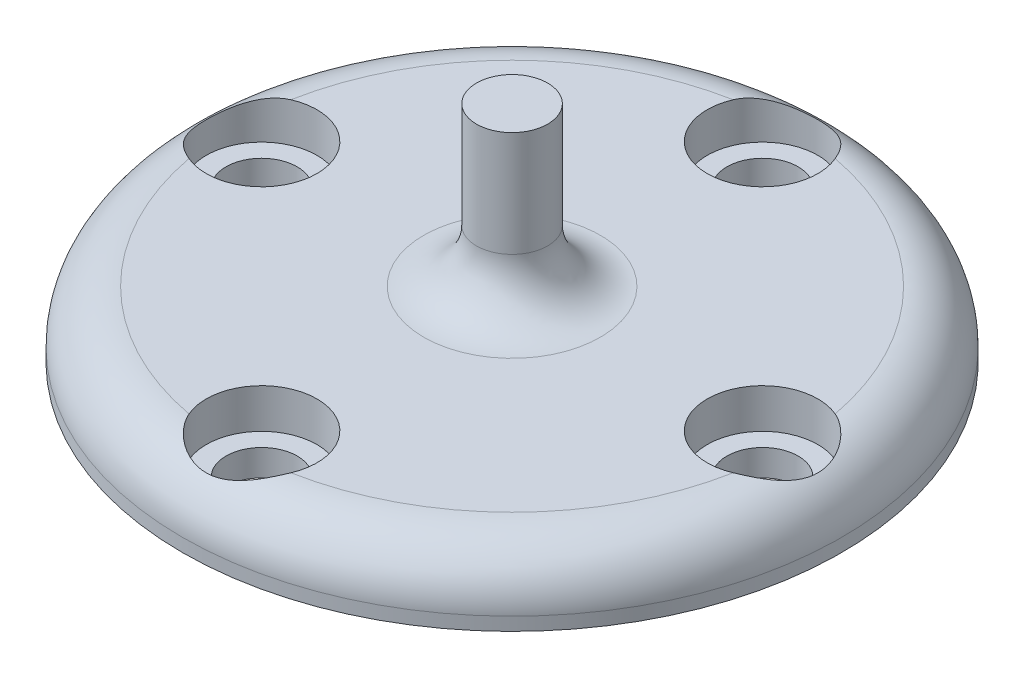
ISO-10303-21;
HEADER;
FILE_DESCRIPTION(('STEP AP214'),'2;1');
FILE_NAME('part.step','',(''),(''),'','','');
FILE_SCHEMA(('AUTOMOTIVE_DESIGN { 1 0 10303 214 1 1 1 1 }'));
ENDSEC;
DATA;
#1=APPLICATION_CONTEXT('core data for automotive mechanical design processes');
#2=APPLICATION_PROTOCOL_DEFINITION('international standard','automotive_design',2000,#1);
#3=PRODUCT_CONTEXT('',#1,'mechanical');
#4=PRODUCT('Part','Part','',(#3));
#5=PRODUCT_RELATED_PRODUCT_CATEGORY('part','',(#4));
#6=PRODUCT_DEFINITION_FORMATION('','',#4);
#7=PRODUCT_DEFINITION_CONTEXT('part definition',#1,'design');
#8=PRODUCT_DEFINITION('design','',#6,#7);
#9=PRODUCT_DEFINITION_SHAPE('','',#8);
#10=(LENGTH_UNIT() NAMED_UNIT(*) SI_UNIT(.MILLI.,.METRE.));
#11=(NAMED_UNIT(*) PLANE_ANGLE_UNIT() SI_UNIT($,.RADIAN.));
#12=(NAMED_UNIT(*) SI_UNIT($,.STERADIAN.) SOLID_ANGLE_UNIT());
#13=UNCERTAINTY_MEASURE_WITH_UNIT(LENGTH_MEASURE(1.E-05),#10,'distance_accuracy_value','');
#14=(GEOMETRIC_REPRESENTATION_CONTEXT(3) GLOBAL_UNCERTAINTY_ASSIGNED_CONTEXT((#13)) GLOBAL_UNIT_ASSIGNED_CONTEXT((#10,
#11,#12)) REPRESENTATION_CONTEXT('',''));
#15=CARTESIAN_POINT('',(0.,0.,0.));
#16=DIRECTION('',(0.,0.,1.));
#17=DIRECTION('',(1.,0.,0.));
#18=AXIS2_PLACEMENT_3D('',#15,#16,#17);
#19=CARTESIAN_POINT('',(0.,0.,-9.5));
#20=DIRECTION('',(0.,1.,0.));
#21=DIRECTION('',(0.,0.,1.));
#22=AXIS2_PLACEMENT_3D('',#19,#20,#21);
#23=CYLINDRICAL_SURFACE('',#22,1.35);
#24=CARTESIAN_POINT('',(0.,0.,-9.5));
#25=DIRECTION('',(0.,1.,0.));
#26=DIRECTION('',(0.,0.,1.));
#27=AXIS2_PLACEMENT_3D('',#24,#25,#26);
#28=CIRCLE('',#27,1.35);
#29=CARTESIAN_POINT('',(0.,0.,-8.15));
#30=VERTEX_POINT('',#29);
#31=EDGE_CURVE('E208',#30,#30,#28,.T.);
#32=ORIENTED_EDGE('',*,*,#31,.F.);
#33=EDGE_LOOP('',(#32));
#34=FACE_BOUND('',#33,.T.);
#35=CARTESIAN_POINT('',(0.,1.,-9.5));
#36=DIRECTION('',(0.,1.,0.));
#37=DIRECTION('',(0.,0.,1.));
#38=AXIS2_PLACEMENT_3D('',#35,#36,#37);
#39=CIRCLE('',#38,1.35);
#40=CARTESIAN_POINT('',(0.,1.,-8.15));
#41=VERTEX_POINT('',#40);
#42=EDGE_CURVE('E211',#41,#41,#39,.F.);
#43=ORIENTED_EDGE('',*,*,#42,.F.);
#44=EDGE_LOOP('',(#43));
#45=FACE_BOUND('',#44,.T.);
#46=ADVANCED_FACE('F42',(#34,#45),#23,.F.);
#47=CARTESIAN_POINT('',(0.,2.5,0.));
#48=DIRECTION('',(0.,-1.,0.));
#49=DIRECTION('',(0.,0.,-1.));
#50=AXIS2_PLACEMENT_3D('',#47,#48,#49);
#51=CYLINDRICAL_SURFACE('',#50,12.5);
#52=CARTESIAN_POINT('',(0.,0.5,0.));
#53=DIRECTION('',(0.,1.,0.));
#54=DIRECTION('',(0.,0.,1.));
#55=AXIS2_PLACEMENT_3D('',#52,#53,#54);
#56=CIRCLE('',#55,12.5);
#57=CARTESIAN_POINT('',(0.,0.5,12.5));
#58=VERTEX_POINT('',#57);
#59=EDGE_CURVE('E11',#58,#58,#56,.F.);
#60=ORIENTED_EDGE('',*,*,#59,.T.);
#61=EDGE_LOOP('',(#60));
#62=FACE_BOUND('',#61,.T.);
#63=CARTESIAN_POINT('',(0.,0.,0.));
#64=DIRECTION('',(0.,1.,0.));
#65=DIRECTION('',(0.,0.,1.));
#66=AXIS2_PLACEMENT_3D('',#63,#64,#65);
#67=CIRCLE('',#66,12.5);
#68=CARTESIAN_POINT('',(0.,0.,12.5));
#69=VERTEX_POINT('',#68);
#70=EDGE_CURVE('E202',#69,#69,#67,.T.);
#71=ORIENTED_EDGE('',*,*,#70,.T.);
#72=EDGE_LOOP('',(#71));
#73=FACE_BOUND('',#72,.T.);
#74=ADVANCED_FACE('F173',(#62,#73),#51,.T.);
#75=CARTESIAN_POINT('',(0.,2.5,0.));
#76=DIRECTION('',(0.,1.,0.));
#77=DIRECTION('',(0.,0.,1.));
#78=AXIS2_PLACEMENT_3D('',#75,#76,#77);
#79=PLANE('',#78);
#80=CARTESIAN_POINT('',(0.,2.5,0.));
#81=DIRECTION('',(0.,1.,0.));
#82=DIRECTION('',(0.,0.,1.));
#83=AXIS2_PLACEMENT_3D('',#80,#81,#82);
#84=CIRCLE('',#83,3.35);
#85=CARTESIAN_POINT('',(0.,2.5,3.35));
#86=VERTEX_POINT('',#85);
#87=EDGE_CURVE('E96',#86,#86,#84,.F.);
#88=ORIENTED_EDGE('',*,*,#87,.T.);
#89=EDGE_LOOP('',(#88));
#90=FACE_BOUND('',#89,.T.);
#91=CARTESIAN_POINT('',(9.5,2.5,0.));
#92=DIRECTION('',(0.,1.,0.));
#93=DIRECTION('',(-1.,0.,0.));
#94=AXIS2_PLACEMENT_3D('',#91,#92,#93);
#95=CIRCLE('',#94,2.1);
#96=CARTESIAN_POINT('',(10.3205263157895,2.5,-1.93306403543618));
#97=VERTEX_POINT('',#96);
#98=CARTESIAN_POINT('',(10.3205263157895,2.5,1.93306403543625));
#99=VERTEX_POINT('',#98);
#100=EDGE_CURVE('E89',#97,#99,#95,.T.);
#101=ORIENTED_EDGE('',*,*,#100,.F.);
#102=CARTESIAN_POINT('',(0.,2.5,0.));
#103=DIRECTION('',(0.,1.,0.));
#104=DIRECTION('',(0.,0.,1.));
#105=AXIS2_PLACEMENT_3D('',#102,#103,#104);
#106=CIRCLE('',#105,10.5);
#107=CARTESIAN_POINT('',(1.93306403543622,2.5,-10.3205263157895));
#108=VERTEX_POINT('',#107);
#109=EDGE_CURVE('E104',#97,#108,#106,.T.);
#110=ORIENTED_EDGE('',*,*,#109,.T.);
#111=CARTESIAN_POINT('',(0.,2.5,-9.5));
#112=DIRECTION('',(0.,1.,0.));
#113=DIRECTION('',(0.,0.,1.));
#114=AXIS2_PLACEMENT_3D('',#111,#112,#113);
#115=CIRCLE('',#114,2.1);
#116=CARTESIAN_POINT('',(-1.93306403543622,2.5,-10.3205263157895));
#117=VERTEX_POINT('',#116);
#118=EDGE_CURVE('E219',#117,#108,#115,.T.);
#119=ORIENTED_EDGE('',*,*,#118,.F.);
#120=CARTESIAN_POINT('',(0.,2.5,0.));
#121=DIRECTION('',(0.,1.,0.));
#122=DIRECTION('',(0.,0.,1.));
#123=AXIS2_PLACEMENT_3D('',#120,#121,#122);
#124=CIRCLE('',#123,10.5);
#125=CARTESIAN_POINT('',(-10.3205263157895,2.5,-1.93306403543633));
#126=VERTEX_POINT('',#125);
#127=EDGE_CURVE('E214',#117,#126,#124,.T.);
#128=ORIENTED_EDGE('',*,*,#127,.T.);
#129=CARTESIAN_POINT('',(-9.5,2.5,0.));
#130=DIRECTION('',(0.,1.,0.));
#131=DIRECTION('',(1.,0.,0.));
#132=AXIS2_PLACEMENT_3D('',#129,#130,#131);
#133=CIRCLE('',#132,2.1);
#134=CARTESIAN_POINT('',(-10.3205263157895,2.5,1.93306403543611));
#135=VERTEX_POINT('',#134);
#136=EDGE_CURVE('E411',#135,#126,#133,.T.);
#137=ORIENTED_EDGE('',*,*,#136,.F.);
#138=CARTESIAN_POINT('',(0.,2.5,0.));
#139=DIRECTION('',(0.,1.,0.));
#140=DIRECTION('',(0.,0.,1.));
#141=AXIS2_PLACEMENT_3D('',#138,#139,#140);
#142=CIRCLE('',#141,10.5);
#143=CARTESIAN_POINT('',(-1.93306403543622,2.5,10.3205263157895));
#144=VERTEX_POINT('',#143);
#145=EDGE_CURVE('E95',#135,#144,#142,.T.);
#146=ORIENTED_EDGE('',*,*,#145,.T.);
#147=CARTESIAN_POINT('',(0.,2.5,9.5));
#148=DIRECTION('',(0.,1.,0.));
#149=DIRECTION('',(0.,0.,-1.));
#150=AXIS2_PLACEMENT_3D('',#147,#148,#149);
#151=CIRCLE('',#150,2.1);
#152=CARTESIAN_POINT('',(1.93306403543622,2.5,10.3205263157895));
#153=VERTEX_POINT('',#152);
#154=EDGE_CURVE('E91',#153,#144,#151,.T.);
#155=ORIENTED_EDGE('',*,*,#154,.F.);
#156=CARTESIAN_POINT('',(0.,2.5,0.));
#157=DIRECTION('',(0.,1.,0.));
#158=DIRECTION('',(0.,0.,1.));
#159=AXIS2_PLACEMENT_3D('',#156,#157,#158);
#160=CIRCLE('',#159,10.5);
#161=EDGE_CURVE('E86',#153,#99,#160,.T.);
#162=ORIENTED_EDGE('',*,*,#161,.T.);
#163=EDGE_LOOP('',(#101,#110,#119,#128,#137,#146,#155,#162));
#164=FACE_BOUND('',#163,.T.);
#165=ADVANCED_FACE('F88',(#90,#164),#79,.T.);
#166=CARTESIAN_POINT('',(0.,0.,0.));
#167=DIRECTION('',(0.,1.,0.));
#168=DIRECTION('',(0.,0.,1.));
#169=AXIS2_PLACEMENT_3D('',#166,#167,#168);
#170=PLANE('',#169);
#171=CARTESIAN_POINT('',(9.5,0.,0.));
#172=DIRECTION('',(0.,1.,0.));
#173=DIRECTION('',(-1.,0.,0.));
#174=AXIS2_PLACEMENT_3D('',#171,#172,#173);
#175=CIRCLE('',#174,1.35);
#176=CARTESIAN_POINT('',(8.15,0.,0.));
#177=VERTEX_POINT('',#176);
#178=EDGE_CURVE('E222',#177,#177,#175,.T.);
#179=ORIENTED_EDGE('',*,*,#178,.T.);
#180=EDGE_LOOP('',(#179));
#181=FACE_BOUND('',#180,.T.);
#182=CARTESIAN_POINT('',(0.,0.,9.5));
#183=DIRECTION('',(0.,1.,0.));
#184=DIRECTION('',(0.,0.,-1.));
#185=AXIS2_PLACEMENT_3D('',#182,#183,#184);
#186=CIRCLE('',#185,1.35);
#187=CARTESIAN_POINT('',(0.,0.,8.15));
#188=VERTEX_POINT('',#187);
#189=EDGE_CURVE('E229',#188,#188,#186,.T.);
#190=ORIENTED_EDGE('',*,*,#189,.T.);
#191=EDGE_LOOP('',(#190));
#192=FACE_BOUND('',#191,.T.);
#193=CARTESIAN_POINT('',(-9.5,0.,0.));
#194=DIRECTION('',(0.,1.,0.));
#195=DIRECTION('',(1.,0.,0.));
#196=AXIS2_PLACEMENT_3D('',#193,#194,#195);
#197=CIRCLE('',#196,1.35);
#198=CARTESIAN_POINT('',(-8.15,0.,0.));
#199=VERTEX_POINT('',#198);
#200=EDGE_CURVE('E439',#199,#199,#197,.T.);
#201=ORIENTED_EDGE('',*,*,#200,.T.);
#202=EDGE_LOOP('',(#201));
#203=FACE_BOUND('',#202,.T.);
#204=ORIENTED_EDGE('',*,*,#31,.T.);
#205=EDGE_LOOP('',(#204));
#206=FACE_BOUND('',#205,.T.);
#207=ORIENTED_EDGE('',*,*,#70,.F.);
#208=EDGE_LOOP('',(#207));
#209=FACE_BOUND('',#208,.T.);
#210=ADVANCED_FACE('F177',(#181,#192,#203,#206,#209),#170,.F.);
#211=CARTESIAN_POINT('',(0.,1.,-9.5));
#212=DIRECTION('',(0.,1.,0.));
#213=DIRECTION('',(0.,0.,1.));
#214=AXIS2_PLACEMENT_3D('',#211,#212,#213);
#215=PLANE('',#214);
#216=CARTESIAN_POINT('',(0.,1.,-9.5));
#217=DIRECTION('',(0.,1.,0.));
#218=DIRECTION('',(0.,0.,1.));
#219=AXIS2_PLACEMENT_3D('',#216,#217,#218);
#220=CIRCLE('',#219,2.1);
#221=CARTESIAN_POINT('',(0.,1.,-7.4));
#222=VERTEX_POINT('',#221);
#223=EDGE_CURVE('E221',#222,#222,#220,.T.);
#224=ORIENTED_EDGE('',*,*,#223,.T.);
#225=EDGE_LOOP('',(#224));
#226=FACE_BOUND('',#225,.T.);
#227=ORIENTED_EDGE('',*,*,#42,.T.);
#228=EDGE_LOOP('',(#227));
#229=FACE_BOUND('',#228,.T.);
#230=ADVANCED_FACE('F168',(#226,#229),#215,.T.);
#231=CARTESIAN_POINT('',(0.,1.,-9.5));
#232=DIRECTION('',(0.,1.,0.));
#233=DIRECTION('',(0.,0.,1.));
#234=AXIS2_PLACEMENT_3D('',#231,#232,#233);
#235=CYLINDRICAL_SURFACE('',#234,2.1);
#236=ORIENTED_EDGE('',*,*,#223,.F.);
#237=EDGE_LOOP('',(#236));
#238=FACE_BOUND('',#237,.T.);
#239=ORIENTED_EDGE('',*,*,#118,.T.);
#240=CARTESIAN_POINT('',(1.93306403543622,2.5,-10.3205263157895));
#241=CARTESIAN_POINT('',(1.91132905672131,2.49999961832988,-10.3717444408581));
#242=CARTESIAN_POINT('',(1.88756873425385,2.49838963240699,-10.4220465364785));
#243=CARTESIAN_POINT('',(1.83624296636833,2.49242163459934,-10.5204329177635));
#244=CARTESIAN_POINT('',(1.80868184138693,2.48806672312854,-10.5685196400375));
#245=CARTESIAN_POINT('',(1.72096337281504,2.47165450989768,-10.7084449977509));
#246=CARTESIAN_POINT('',(1.65548462936347,2.45623744554816,-10.7966177797015));
#247=CARTESIAN_POINT('',(1.51265917862033,2.42013514019515,-10.9607114997058));
#248=CARTESIAN_POINT('',(1.43535933010573,2.39947049576991,-11.0366784842397));
#249=CARTESIAN_POINT('',(1.27019927530654,2.35617538127799,-11.175789829565));
#250=CARTESIAN_POINT('',(1.18231779838032,2.33354097788891,-11.2389076529849));
#251=CARTESIAN_POINT('',(0.98823597400308,2.28738789017066,-11.3567586801814));
#252=CARTESIAN_POINT('',(0.881081590587174,2.26401301221837,-11.4099884443426));
#253=CARTESIAN_POINT('',(0.658344434347103,2.22322876078335,-11.4977177329108));
#254=CARTESIAN_POINT('',(0.542770471058801,2.20581325763098,-11.5322365244562));
#255=CARTESIAN_POINT('',(0.310587658280363,2.18107364258961,-11.5801593446191));
#256=CARTESIAN_POINT('',(0.194165203459503,2.17340942103465,-11.5942774826308));
#257=CARTESIAN_POINT('',(-0.0395889153359825,2.16878275815608,-11.6028770520494));
#258=CARTESIAN_POINT('',(-0.156920067208939,2.17181467275473,-11.5973688397644));
#259=CARTESIAN_POINT('',(-0.376420512622768,2.18701945953241,-11.5686465865022));
#260=CARTESIAN_POINT('',(-0.478912835895899,2.19822534522196,-11.5473017605088));
#261=CARTESIAN_POINT('',(-0.67882097340653,2.22670907795637,-11.4899810426584));
#262=CARTESIAN_POINT('',(-0.77623495282563,2.2439891023813,-11.4539999034337));
#263=CARTESIAN_POINT('',(-0.970097536844045,2.28323187662073,-11.3657338257719));
#264=CARTESIAN_POINT('',(-1.06609453619346,2.30542183567198,-11.3125608792062));
#265=CARTESIAN_POINT('',(-1.24867006341348,2.35038956374346,-11.1919882951354));
#266=CARTESIAN_POINT('',(-1.33523608562803,2.37316806486343,-11.1245701079558));
#267=CARTESIAN_POINT('',(-1.50531336556556,2.41798485133229,-10.9691960808331));
#268=CARTESIAN_POINT('',(-1.58767309090899,2.43972642719117,-10.879867537995));
#269=CARTESIAN_POINT('',(-1.69903243681017,2.46608550364456,-10.7357100740039));
#270=CARTESIAN_POINT('',(-1.73409217684718,2.4738248616877,-10.6860201303772));
#271=CARTESIAN_POINT('',(-1.79989342298202,2.4866168954847,-10.5835493879999));
#272=CARTESIAN_POINT('',(-1.83063881342114,2.49167199952228,-10.5307714309491));
#273=CARTESIAN_POINT('',(-1.87244444133776,2.49667032873985,-10.4512006710273));
#274=CARTESIAN_POINT('',(-1.88531796360996,2.4979031794686,-10.4254226496254));
#275=CARTESIAN_POINT('',(-1.90999658484607,2.49956775499015,-10.373351232458));
#276=CARTESIAN_POINT('',(-1.92180222482917,2.4999998876361,-10.3470581059672));
#277=CARTESIAN_POINT('',(-1.93306403543622,2.5,-10.3205263157895));
#278=B_SPLINE_CURVE_WITH_KNOTS('',3,(#240,#241,#242,#243,#244,#245,#246,#247,#248,#249,#250,
#251,#252,#253,#254,#255,#256,#257,#258,#259,#260,#261,#262,#263,#264,#265,#266,#267,#268,#269,
#270,#271,#272,#273,#274,#275,#276,#277),.UNSPECIFIED.,.F.,.F.,(4,2,2,2,2,2,2,2,2,2,2,2,2,2,2,2,
2,2,4),(0.,0.166762011289944,0.33333600035294,0.664332830745989,0.994050065205936,
1.32444150639117,1.68840110337821,2.05198520699984,2.40250537261012,2.75284060535734,
3.06733163892712,3.38193552240494,3.71645785139043,4.05141849865201,4.41955147924907,
4.60323822978949,4.78675852561109,4.87324891387092,4.95969523533052),.UNSPECIFIED.);
#279=EDGE_CURVE('E58',#108,#117,#278,.T.);
#280=ORIENTED_EDGE('',*,*,#279,.T.);
#281=EDGE_LOOP('',(#239,#280));
#282=FACE_BOUND('',#281,.T.);
#283=ADVANCED_FACE('F162',(#238,#282),#235,.F.);
#284=CARTESIAN_POINT('',(-9.5,0.,0.));
#285=DIRECTION('',(0.,1.,0.));
#286=DIRECTION('',(1.,0.,0.));
#287=AXIS2_PLACEMENT_3D('',#284,#285,#286);
#288=CYLINDRICAL_SURFACE('',#287,1.35);
#289=ORIENTED_EDGE('',*,*,#200,.F.);
#290=EDGE_LOOP('',(#289));
#291=FACE_BOUND('',#290,.T.);
#292=CARTESIAN_POINT('',(-9.5,1.,0.));
#293=DIRECTION('',(0.,1.,0.));
#294=DIRECTION('',(0.,0.,1.));
#295=AXIS2_PLACEMENT_3D('',#292,#293,#294);
#296=CIRCLE('',#295,1.35);
#297=CARTESIAN_POINT('',(-9.5,1.,1.3499999999999));
#298=VERTEX_POINT('',#297);
#299=EDGE_CURVE('E436',#298,#298,#296,.F.);
#300=ORIENTED_EDGE('',*,*,#299,.F.);
#301=EDGE_LOOP('',(#300));
#302=FACE_BOUND('',#301,.T.);
#303=ADVANCED_FACE('F167',(#291,#302),#288,.F.);
#304=CARTESIAN_POINT('',(0.,0.,9.5));
#305=DIRECTION('',(0.,1.,0.));
#306=DIRECTION('',(0.,0.,-1.));
#307=AXIS2_PLACEMENT_3D('',#304,#305,#306);
#308=CYLINDRICAL_SURFACE('',#307,1.35);
#309=ORIENTED_EDGE('',*,*,#189,.F.);
#310=EDGE_LOOP('',(#309));
#311=FACE_BOUND('',#310,.T.);
#312=CARTESIAN_POINT('',(0.,1.,9.5));
#313=DIRECTION('',(0.,1.,0.));
#314=DIRECTION('',(0.,0.,1.));
#315=AXIS2_PLACEMENT_3D('',#312,#313,#314);
#316=CIRCLE('',#315,1.35);
#317=CARTESIAN_POINT('',(0.,1.,10.85));
#318=VERTEX_POINT('',#317);
#319=EDGE_CURVE('E432',#318,#318,#316,.F.);
#320=ORIENTED_EDGE('',*,*,#319,.F.);
#321=EDGE_LOOP('',(#320));
#322=FACE_BOUND('',#321,.T.);
#323=ADVANCED_FACE('F265',(#311,#322),#308,.F.);
#324=CARTESIAN_POINT('',(9.5,0.,0.));
#325=DIRECTION('',(0.,1.,0.));
#326=DIRECTION('',(-1.,0.,0.));
#327=AXIS2_PLACEMENT_3D('',#324,#325,#326);
#328=CYLINDRICAL_SURFACE('',#327,1.35);
#329=ORIENTED_EDGE('',*,*,#178,.F.);
#330=EDGE_LOOP('',(#329));
#331=FACE_BOUND('',#330,.T.);
#332=CARTESIAN_POINT('',(9.5,1.,0.));
#333=DIRECTION('',(0.,1.,0.));
#334=DIRECTION('',(0.,0.,1.));
#335=AXIS2_PLACEMENT_3D('',#332,#333,#334);
#336=CIRCLE('',#335,1.35);
#337=CARTESIAN_POINT('',(9.5,1.,1.35000000000003));
#338=VERTEX_POINT('',#337);
#339=EDGE_CURVE('E420',#338,#338,#336,.F.);
#340=ORIENTED_EDGE('',*,*,#339,.F.);
#341=EDGE_LOOP('',(#340));
#342=FACE_BOUND('',#341,.T.);
#343=ADVANCED_FACE('F131',(#331,#342),#328,.F.);
#344=CARTESIAN_POINT('',(9.5,1.,0.));
#345=DIRECTION('',(0.,1.,0.));
#346=DIRECTION('',(-1.,0.,0.));
#347=AXIS2_PLACEMENT_3D('',#344,#345,#346);
#348=PLANE('',#347);
#349=CARTESIAN_POINT('',(9.5,1.,0.));
#350=DIRECTION('',(0.,1.,0.));
#351=DIRECTION('',(-1.,0.,0.));
#352=AXIS2_PLACEMENT_3D('',#349,#350,#351);
#353=CIRCLE('',#352,2.1);
#354=CARTESIAN_POINT('',(7.4,1.,0.));
#355=VERTEX_POINT('',#354);
#356=EDGE_CURVE('E101',#355,#355,#353,.T.);
#357=ORIENTED_EDGE('',*,*,#356,.T.);
#358=EDGE_LOOP('',(#357));
#359=FACE_BOUND('',#358,.T.);
#360=ORIENTED_EDGE('',*,*,#339,.T.);
#361=EDGE_LOOP('',(#360));
#362=FACE_BOUND('',#361,.T.);
#363=ADVANCED_FACE('F126',(#359,#362),#348,.T.);
#364=CARTESIAN_POINT('',(9.5,1.,0.));
#365=DIRECTION('',(0.,1.,0.));
#366=DIRECTION('',(-1.,0.,0.));
#367=AXIS2_PLACEMENT_3D('',#364,#365,#366);
#368=CYLINDRICAL_SURFACE('',#367,2.1);
#369=ORIENTED_EDGE('',*,*,#356,.F.);
#370=EDGE_LOOP('',(#369));
#371=FACE_BOUND('',#370,.T.);
#372=ORIENTED_EDGE('',*,*,#100,.T.);
#373=CARTESIAN_POINT('',(10.3205263157895,2.5,1.93306403543625));
#374=CARTESIAN_POINT('',(10.3717444408581,2.49999961832988,1.91132905672134));
#375=CARTESIAN_POINT('',(10.4220465364785,2.49838963240699,1.88756873425389));
#376=CARTESIAN_POINT('',(10.5204329177635,2.49242163459934,1.83624296636836));
#377=CARTESIAN_POINT('',(10.5685196400375,2.48806672312854,1.80868184138697));
#378=CARTESIAN_POINT('',(10.7084449977509,2.47165450989768,1.72096337281507));
#379=CARTESIAN_POINT('',(10.7966177797015,2.45623744554816,1.65548462936351));
#380=CARTESIAN_POINT('',(10.9607114997058,2.42013514019515,1.51265917862037));
#381=CARTESIAN_POINT('',(11.0366784842397,2.39947049576991,1.43535933010577));
#382=CARTESIAN_POINT('',(11.175789829565,2.35617538127799,1.27019927530657));
#383=CARTESIAN_POINT('',(11.2389076529849,2.33354097788891,1.18231779838036));
#384=CARTESIAN_POINT('',(11.3567586801814,2.28738789017066,0.988235974003118));
#385=CARTESIAN_POINT('',(11.4099884443426,2.26401301221837,0.881081590587213));
#386=CARTESIAN_POINT('',(11.4977177329108,2.22322876078335,0.658344434347142));
#387=CARTESIAN_POINT('',(11.5322365244562,2.20581325763098,0.54277047105884));
#388=CARTESIAN_POINT('',(11.5801593446191,2.18107364258961,0.310587658280403));
#389=CARTESIAN_POINT('',(11.5942774826308,2.17340942103465,0.194165203459542));
#390=CARTESIAN_POINT('',(11.6028770520494,2.16878275815608,-0.039588915335943));
#391=CARTESIAN_POINT('',(11.5973688397644,2.17181467275473,-0.156920067208899));
#392=CARTESIAN_POINT('',(11.5686465865022,2.18701945953241,-0.376420512622729));
#393=CARTESIAN_POINT('',(11.5473017605088,2.19822534522195,-0.47891283589586));
#394=CARTESIAN_POINT('',(11.4899810426584,2.22670907795637,-0.678820973406491));
#395=CARTESIAN_POINT('',(11.4539999034337,2.2439891023813,-0.776234952825591));
#396=CARTESIAN_POINT('',(11.3657338257719,2.28323187662073,-0.970097536844006));
#397=CARTESIAN_POINT('',(11.3125608792062,2.30542183567198,-1.06609453619342));
#398=CARTESIAN_POINT('',(11.1919882951354,2.35038956374346,-1.24867006341344));
#399=CARTESIAN_POINT('',(11.1245701079558,2.37316806486343,-1.33523608562799));
#400=CARTESIAN_POINT('',(10.9691960808331,2.41798485133229,-1.50531336556552));
#401=CARTESIAN_POINT('',(10.879867537995,2.43972642719117,-1.58767309090896));
#402=CARTESIAN_POINT('',(10.7357100740039,2.46608550364456,-1.69903243681013));
#403=CARTESIAN_POINT('',(10.6860201303772,2.4738248616877,-1.73409217684715));
#404=CARTESIAN_POINT('',(10.5835493879999,2.4866168954847,-1.79989342298199));
#405=CARTESIAN_POINT('',(10.5307714309491,2.49167199952228,-1.83063881342111));
#406=CARTESIAN_POINT('',(10.4512006710273,2.49667032873985,-1.87244444133772));
#407=CARTESIAN_POINT('',(10.4254226496254,2.4979031794686,-1.88531796360992));
#408=CARTESIAN_POINT('',(10.373351232458,2.49956775499015,-1.90999658484603));
#409=CARTESIAN_POINT('',(10.3470581059672,2.4999998876361,-1.92180222482913));
#410=CARTESIAN_POINT('',(10.3205263157895,2.5,-1.93306403543618));
#411=B_SPLINE_CURVE_WITH_KNOTS('',3,(#373,#374,#375,#376,#377,#378,#379,#380,#381,#382,#383,
#384,#385,#386,#387,#388,#389,#390,#391,#392,#393,#394,#395,#396,#397,#398,#399,#400,#401,#402,
#403,#404,#405,#406,#407,#408,#409,#410),.UNSPECIFIED.,.F.,.F.,(4,2,2,2,2,2,2,2,2,2,2,2,2,2,2,2,
2,2,4),(0.,0.166762011289944,0.333336000352939,0.664332830745989,0.994050065205936,
1.32444150639117,1.68840110337821,2.05198520699984,2.40250537261012,2.75284060535734,
3.06733163892712,3.38193552240494,3.71645785139043,4.05141849865201,4.41955147924907,
4.6032382297895,4.78675852561109,4.87324891387092,4.95969523533052),.UNSPECIFIED.);
#412=EDGE_CURVE('E52',#99,#97,#411,.T.);
#413=ORIENTED_EDGE('',*,*,#412,.T.);
#414=EDGE_LOOP('',(#372,#413));
#415=FACE_BOUND('',#414,.T.);
#416=ADVANCED_FACE('F99',(#371,#415),#368,.F.);
#417=CARTESIAN_POINT('',(0.,1.,9.5));
#418=DIRECTION('',(0.,1.,0.));
#419=DIRECTION('',(0.,0.,-1.));
#420=AXIS2_PLACEMENT_3D('',#417,#418,#419);
#421=PLANE('',#420);
#422=CARTESIAN_POINT('',(0.,1.,9.5));
#423=DIRECTION('',(0.,1.,0.));
#424=DIRECTION('',(0.,0.,-1.));
#425=AXIS2_PLACEMENT_3D('',#422,#423,#424);
#426=CIRCLE('',#425,2.1);
#427=CARTESIAN_POINT('',(0.,1.,7.4));
#428=VERTEX_POINT('',#427);
#429=EDGE_CURVE('E102',#428,#428,#426,.T.);
#430=ORIENTED_EDGE('',*,*,#429,.T.);
#431=EDGE_LOOP('',(#430));
#432=FACE_BOUND('',#431,.T.);
#433=ORIENTED_EDGE('',*,*,#319,.T.);
#434=EDGE_LOOP('',(#433));
#435=FACE_BOUND('',#434,.T.);
#436=ADVANCED_FACE('F125',(#432,#435),#421,.T.);
#437=CARTESIAN_POINT('',(0.,1.,9.5));
#438=DIRECTION('',(0.,1.,0.));
#439=DIRECTION('',(0.,0.,-1.));
#440=AXIS2_PLACEMENT_3D('',#437,#438,#439);
#441=CYLINDRICAL_SURFACE('',#440,2.1);
#442=ORIENTED_EDGE('',*,*,#429,.F.);
#443=EDGE_LOOP('',(#442));
#444=FACE_BOUND('',#443,.T.);
#445=ORIENTED_EDGE('',*,*,#154,.T.);
#446=CARTESIAN_POINT('',(-1.93306403543622,2.5,10.3205263157895));
#447=CARTESIAN_POINT('',(-1.91132905672131,2.49999961832988,10.3717444408581));
#448=CARTESIAN_POINT('',(-1.88756873425385,2.49838963240699,10.4220465364785));
#449=CARTESIAN_POINT('',(-1.83624296636833,2.49242163459934,10.5204329177635));
#450=CARTESIAN_POINT('',(-1.80868184138693,2.48806672312854,10.5685196400375));
#451=CARTESIAN_POINT('',(-1.72096337281504,2.47165450989768,10.7084449977509));
#452=CARTESIAN_POINT('',(-1.65548462936347,2.45623744554816,10.7966177797015));
#453=CARTESIAN_POINT('',(-1.51265917862033,2.42013514019515,10.9607114997058));
#454=CARTESIAN_POINT('',(-1.43535933010573,2.39947049576991,11.0366784842397));
#455=CARTESIAN_POINT('',(-1.27019927530654,2.35617538127799,11.175789829565));
#456=CARTESIAN_POINT('',(-1.18231779838032,2.33354097788891,11.2389076529849));
#457=CARTESIAN_POINT('',(-0.98823597400308,2.28738789017066,11.3567586801814));
#458=CARTESIAN_POINT('',(-0.881081590587174,2.26401301221837,11.4099884443426));
#459=CARTESIAN_POINT('',(-0.658344434347103,2.22322876078335,11.4977177329108));
#460=CARTESIAN_POINT('',(-0.542770471058801,2.20581325763098,11.5322365244562));
#461=CARTESIAN_POINT('',(-0.310587658280363,2.18107364258961,11.5801593446191));
#462=CARTESIAN_POINT('',(-0.194165203459503,2.17340942103465,11.5942774826308));
#463=CARTESIAN_POINT('',(0.0395889153359825,2.16878275815608,11.6028770520494));
#464=CARTESIAN_POINT('',(0.156920067208939,2.17181467275473,11.5973688397644));
#465=CARTESIAN_POINT('',(0.376420512622768,2.18701945953241,11.5686465865022));
#466=CARTESIAN_POINT('',(0.478912835895899,2.19822534522196,11.5473017605088));
#467=CARTESIAN_POINT('',(0.67882097340653,2.22670907795637,11.4899810426584));
#468=CARTESIAN_POINT('',(0.77623495282563,2.2439891023813,11.4539999034337));
#469=CARTESIAN_POINT('',(0.970097536844045,2.28323187662073,11.3657338257719));
#470=CARTESIAN_POINT('',(1.06609453619346,2.30542183567198,11.3125608792062));
#471=CARTESIAN_POINT('',(1.24867006341348,2.35038956374346,11.1919882951354));
#472=CARTESIAN_POINT('',(1.33523608562803,2.37316806486343,11.1245701079558));
#473=CARTESIAN_POINT('',(1.50531336556556,2.41798485133229,10.9691960808331));
#474=CARTESIAN_POINT('',(1.58767309090899,2.43972642719117,10.879867537995));
#475=CARTESIAN_POINT('',(1.69903243681017,2.46608550364456,10.7357100740039));
#476=CARTESIAN_POINT('',(1.73409217684718,2.4738248616877,10.6860201303772));
#477=CARTESIAN_POINT('',(1.79989342298202,2.4866168954847,10.5835493879999));
#478=CARTESIAN_POINT('',(1.83063881342114,2.49167199952228,10.5307714309491));
#479=CARTESIAN_POINT('',(1.87244444133776,2.49667032873985,10.4512006710273));
#480=CARTESIAN_POINT('',(1.88531796360996,2.4979031794686,10.4254226496254));
#481=CARTESIAN_POINT('',(1.90999658484607,2.49956775499015,10.373351232458));
#482=CARTESIAN_POINT('',(1.92180222482917,2.4999998876361,10.3470581059672));
#483=CARTESIAN_POINT('',(1.93306403543622,2.5,10.3205263157895));
#484=B_SPLINE_CURVE_WITH_KNOTS('',3,(#446,#447,#448,#449,#450,#451,#452,#453,#454,#455,#456,
#457,#458,#459,#460,#461,#462,#463,#464,#465,#466,#467,#468,#469,#470,#471,#472,#473,#474,#475,
#476,#477,#478,#479,#480,#481,#482,#483),.UNSPECIFIED.,.F.,.F.,(4,2,2,2,2,2,2,2,2,2,2,2,2,2,2,2,
2,2,4),(0.,0.166762011289944,0.33333600035294,0.664332830745989,0.994050065205936,
1.32444150639117,1.68840110337821,2.05198520699984,2.40250537261012,2.75284060535734,
3.06733163892712,3.38193552240494,3.71645785139043,4.05141849865201,4.41955147924907,
4.60323822978949,4.78675852561109,4.87324891387092,4.95969523533052),.UNSPECIFIED.);
#485=EDGE_CURVE('E106',#144,#153,#484,.T.);
#486=ORIENTED_EDGE('',*,*,#485,.T.);
#487=EDGE_LOOP('',(#445,#486));
#488=FACE_BOUND('',#487,.T.);
#489=ADVANCED_FACE('F133',(#444,#488),#441,.F.);
#490=CARTESIAN_POINT('',(-9.5,1.,0.));
#491=DIRECTION('',(0.,1.,0.));
#492=DIRECTION('',(1.,0.,0.));
#493=AXIS2_PLACEMENT_3D('',#490,#491,#492);
#494=PLANE('',#493);
#495=CARTESIAN_POINT('',(-9.5,1.,0.));
#496=DIRECTION('',(0.,1.,0.));
#497=DIRECTION('',(1.,0.,0.));
#498=AXIS2_PLACEMENT_3D('',#495,#496,#497);
#499=CIRCLE('',#498,2.1);
#500=CARTESIAN_POINT('',(-7.4,1.,0.));
#501=VERTEX_POINT('',#500);
#502=EDGE_CURVE('E414',#501,#501,#499,.T.);
#503=ORIENTED_EDGE('',*,*,#502,.T.);
#504=EDGE_LOOP('',(#503));
#505=FACE_BOUND('',#504,.T.);
#506=ORIENTED_EDGE('',*,*,#299,.T.);
#507=EDGE_LOOP('',(#506));
#508=FACE_BOUND('',#507,.T.);
#509=ADVANCED_FACE('F137',(#505,#508),#494,.T.);
#510=CARTESIAN_POINT('',(-9.5,1.,0.));
#511=DIRECTION('',(0.,1.,0.));
#512=DIRECTION('',(1.,0.,0.));
#513=AXIS2_PLACEMENT_3D('',#510,#511,#512);
#514=CYLINDRICAL_SURFACE('',#513,2.1);
#515=ORIENTED_EDGE('',*,*,#502,.F.);
#516=EDGE_LOOP('',(#515));
#517=FACE_BOUND('',#516,.T.);
#518=ORIENTED_EDGE('',*,*,#136,.T.);
#519=CARTESIAN_POINT('',(-10.3205263157895,2.5,-1.93306403543633));
#520=CARTESIAN_POINT('',(-10.371744440858,2.49999961832988,-1.91132905672142));
#521=CARTESIAN_POINT('',(-10.4220465364785,2.49838963240699,-1.88756873425396));
#522=CARTESIAN_POINT('',(-10.5204329177635,2.49242163459934,-1.83624296636844));
#523=CARTESIAN_POINT('',(-10.5685196400374,2.48806672312854,-1.80868184138705));
#524=CARTESIAN_POINT('',(-10.7084449977509,2.47165450989768,-1.72096337281515));
#525=CARTESIAN_POINT('',(-10.7966177797015,2.45623744554816,-1.65548462936359));
#526=CARTESIAN_POINT('',(-10.9607114997057,2.42013514019515,-1.51265917862044));
#527=CARTESIAN_POINT('',(-11.0366784842397,2.39947049576991,-1.43535933010585));
#528=CARTESIAN_POINT('',(-11.175789829565,2.35617538127799,-1.27019927530665));
#529=CARTESIAN_POINT('',(-11.2389076529849,2.33354097788891,-1.18231779838044));
#530=CARTESIAN_POINT('',(-11.3567586801813,2.28738789017066,-0.9882359740032));
#531=CARTESIAN_POINT('',(-11.4099884443426,2.26401301221837,-0.881081590587294));
#532=CARTESIAN_POINT('',(-11.4977177329108,2.22322876078335,-0.658344434347224));
#533=CARTESIAN_POINT('',(-11.5322365244562,2.20581325763098,-0.542770471058924));
#534=CARTESIAN_POINT('',(-11.5801593446191,2.18107364258961,-0.310587658280487));
#535=CARTESIAN_POINT('',(-11.5942774826308,2.17340942103465,-0.194165203459626));
#536=CARTESIAN_POINT('',(-11.6028770520494,2.16878275815608,0.0395889153358588));
#537=CARTESIAN_POINT('',(-11.5973688397644,2.17181467275473,0.156920067208815));
#538=CARTESIAN_POINT('',(-11.5686465865022,2.18701945953241,0.376420512622645));
#539=CARTESIAN_POINT('',(-11.5473017605088,2.19822534522195,0.478912835895776));
#540=CARTESIAN_POINT('',(-11.4899810426584,2.22670907795637,0.678820973406408));
#541=CARTESIAN_POINT('',(-11.4539999034337,2.2439891023813,0.776234952825508));
#542=CARTESIAN_POINT('',(-11.3657338257719,2.28323187662073,0.970097536843924));
#543=CARTESIAN_POINT('',(-11.3125608792062,2.30542183567198,1.06609453619334));
#544=CARTESIAN_POINT('',(-11.1919882951355,2.35038956374346,1.24867006341336));
#545=CARTESIAN_POINT('',(-11.1245701079558,2.37316806486343,1.33523608562791));
#546=CARTESIAN_POINT('',(-10.9691960808332,2.41798485133229,1.50531336556544));
#547=CARTESIAN_POINT('',(-10.879867537995,2.43972642719117,1.58767309090888));
#548=CARTESIAN_POINT('',(-10.7357100740039,2.46608550364456,1.69903243681006));
#549=CARTESIAN_POINT('',(-10.6860201303772,2.4738248616877,1.73409217684707));
#550=CARTESIAN_POINT('',(-10.5835493879999,2.4866168954847,1.79989342298191));
#551=CARTESIAN_POINT('',(-10.5307714309491,2.49167199952228,1.83063881342103));
#552=CARTESIAN_POINT('',(-10.4512006710273,2.49667032873985,1.87244444133765));
#553=CARTESIAN_POINT('',(-10.4254226496254,2.4979031794686,1.88531796360985));
#554=CARTESIAN_POINT('',(-10.373351232458,2.49956775499015,1.90999658484596));
#555=CARTESIAN_POINT('',(-10.3470581059672,2.4999998876361,1.92180222482906));
#556=CARTESIAN_POINT('',(-10.3205263157895,2.5,1.93306403543611));
#557=B_SPLINE_CURVE_WITH_KNOTS('',3,(#519,#520,#521,#522,#523,#524,#525,#526,#527,#528,#529,
#530,#531,#532,#533,#534,#535,#536,#537,#538,#539,#540,#541,#542,#543,#544,#545,#546,#547,#548,
#549,#550,#551,#552,#553,#554,#555,#556),.UNSPECIFIED.,.F.,.F.,(4,2,2,2,2,2,2,2,2,2,2,2,2,2,2,2,
2,2,4),(0.,0.166762011289943,0.333336000352938,0.664332830745988,0.994050065205938,
1.32444150639117,1.68840110337821,2.05198520699984,2.40250537261012,2.75284060535734,
3.06733163892712,3.38193552240494,3.71645785139043,4.05141849865201,4.41955147924907,
4.60323822978949,4.78675852561108,4.87324891387092,4.95969523533052),.UNSPECIFIED.);
#558=EDGE_CURVE('E108',#126,#135,#557,.T.);
#559=ORIENTED_EDGE('',*,*,#558,.T.);
#560=EDGE_LOOP('',(#518,#559));
#561=FACE_BOUND('',#560,.T.);
#562=ADVANCED_FACE('F142',(#517,#561),#514,.F.);
#563=CARTESIAN_POINT('',(0.,8.5,0.));
#564=DIRECTION('',(0.,-1.,0.));
#565=DIRECTION('',(0.,0.,-1.));
#566=AXIS2_PLACEMENT_3D('',#563,#564,#565);
#567=CYLINDRICAL_SURFACE('',#566,1.35);
#568=CARTESIAN_POINT('',(0.,4.5,0.));
#569=DIRECTION('',(0.,1.,0.));
#570=DIRECTION('',(0.,0.,1.));
#571=AXIS2_PLACEMENT_3D('',#568,#569,#570);
#572=CIRCLE('',#571,1.35);
#573=CARTESIAN_POINT('',(0.,4.5,1.35));
#574=VERTEX_POINT('',#573);
#575=EDGE_CURVE('E199',#574,#574,#572,.T.);
#576=ORIENTED_EDGE('',*,*,#575,.T.);
#577=EDGE_LOOP('',(#576));
#578=FACE_BOUND('',#577,.T.);
#579=CARTESIAN_POINT('',(0.,8.5,0.));
#580=DIRECTION('',(0.,1.,0.));
#581=DIRECTION('',(0.,0.,1.));
#582=AXIS2_PLACEMENT_3D('',#579,#580,#581);
#583=CIRCLE('',#582,1.35);
#584=CARTESIAN_POINT('',(0.,8.5,1.35));
#585=VERTEX_POINT('',#584);
#586=EDGE_CURVE('E409',#585,#585,#583,.T.);
#587=ORIENTED_EDGE('',*,*,#586,.F.);
#588=EDGE_LOOP('',(#587));
#589=FACE_BOUND('',#588,.T.);
#590=ADVANCED_FACE('F128',(#578,#589),#567,.T.);
#591=CARTESIAN_POINT('',(0.,8.5,0.));
#592=DIRECTION('',(0.,1.,0.));
#593=DIRECTION('',(0.,0.,1.));
#594=AXIS2_PLACEMENT_3D('',#591,#592,#593);
#595=PLANE('',#594);
#596=ORIENTED_EDGE('',*,*,#586,.T.);
#597=EDGE_LOOP('',(#596));
#598=FACE_BOUND('',#597,.T.);
#599=ADVANCED_FACE('F186',(#598),#595,.T.);
#600=CARTESIAN_POINT('',(0.,4.5,0.));
#601=DIRECTION('',(0.,1.,0.));
#602=DIRECTION('',(0.,0.,1.));
#603=AXIS2_PLACEMENT_3D('',#600,#601,#602);
#604=TOROIDAL_SURFACE('',#603,3.35,2.);
#605=ORIENTED_EDGE('',*,*,#87,.F.);
#606=EDGE_LOOP('',(#605));
#607=FACE_BOUND('',#606,.T.);
#608=ORIENTED_EDGE('',*,*,#575,.F.);
#609=EDGE_LOOP('',(#608));
#610=FACE_BOUND('',#609,.T.);
#611=ADVANCED_FACE('F184',(#607,#610),#604,.F.);
#612=CARTESIAN_POINT('',(0.,0.5,0.));
#613=DIRECTION('',(0.,1.,0.));
#614=DIRECTION('',(0.,0.,1.));
#615=AXIS2_PLACEMENT_3D('',#612,#613,#614);
#616=TOROIDAL_SURFACE('',#615,10.5,2.);
#617=ORIENTED_EDGE('',*,*,#59,.F.);
#618=EDGE_LOOP('',(#617));
#619=FACE_BOUND('',#618,.T.);
#620=ORIENTED_EDGE('',*,*,#279,.F.);
#621=ORIENTED_EDGE('',*,*,#109,.F.);
#622=ORIENTED_EDGE('',*,*,#412,.F.);
#623=ORIENTED_EDGE('',*,*,#161,.F.);
#624=ORIENTED_EDGE('',*,*,#485,.F.);
#625=ORIENTED_EDGE('',*,*,#145,.F.);
#626=ORIENTED_EDGE('',*,*,#558,.F.);
#627=ORIENTED_EDGE('',*,*,#127,.F.);
#628=EDGE_LOOP('',(#620,#621,#622,#623,#624,#625,#626,#627));
#629=FACE_BOUND('',#628,.T.);
#630=ADVANCED_FACE('F44',(#619,#629),#616,.T.);
#631=CLOSED_SHELL('',(#46,#74,#165,#210,#230,#283,#303,#323,#343,#363,#416,#436,#489,#509,#562,
#590,#599,#611,#630));
#632=MANIFOLD_SOLID_BREP('B2',#631);
#633=ADVANCED_BREP_SHAPE_REPRESENTATION('',(#18,#632),#14);
#634=SHAPE_DEFINITION_REPRESENTATION(#9,#633);
ENDSEC;
END-ISO-10303-21;
